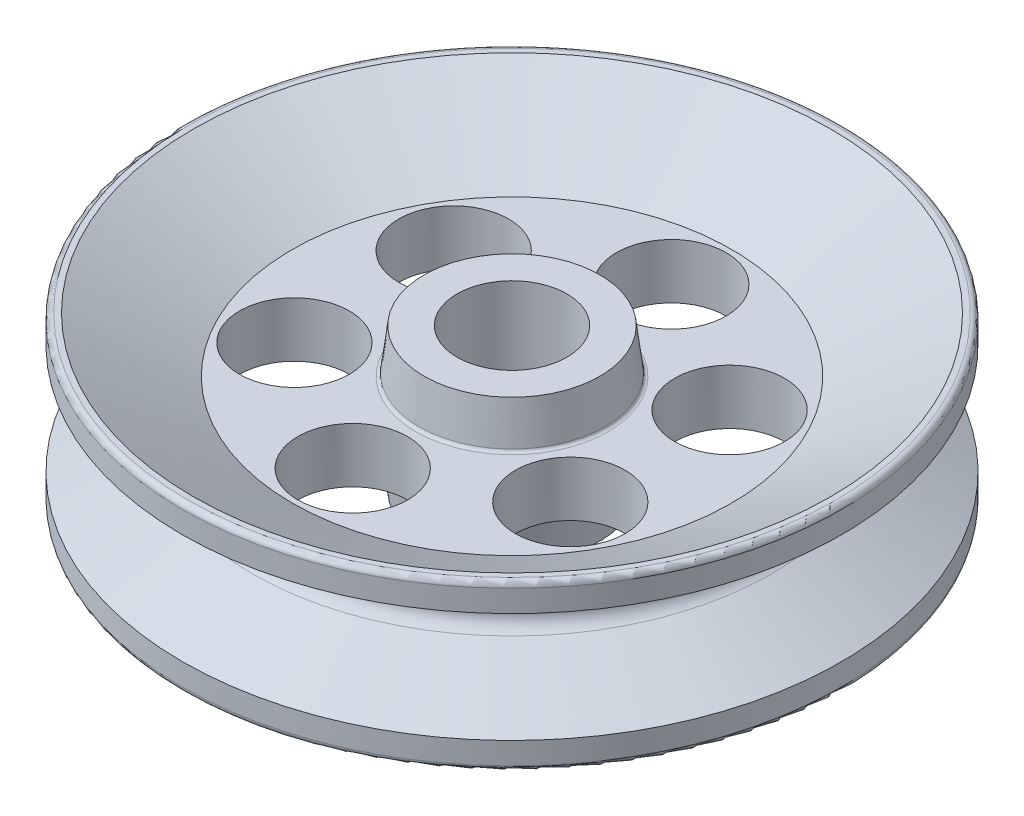
ISO-10303-21;
HEADER;
FILE_DESCRIPTION(('STEP AP214'),'2;1');
FILE_NAME('part.step','',(''),(''),'','','');
FILE_SCHEMA(('AUTOMOTIVE_DESIGN { 1 0 10303 214 1 1 1 1 }'));
ENDSEC;
DATA;
#1=APPLICATION_CONTEXT('core data for automotive mechanical design processes');
#2=APPLICATION_PROTOCOL_DEFINITION('international standard','automotive_design',2000,#1);
#3=PRODUCT_CONTEXT('',#1,'mechanical');
#4=PRODUCT('Part','Part','',(#3));
#5=PRODUCT_RELATED_PRODUCT_CATEGORY('part','',(#4));
#6=PRODUCT_DEFINITION_FORMATION('','',#4);
#7=PRODUCT_DEFINITION_CONTEXT('part definition',#1,'design');
#8=PRODUCT_DEFINITION('design','',#6,#7);
#9=PRODUCT_DEFINITION_SHAPE('','',#8);
#10=(LENGTH_UNIT() NAMED_UNIT(*) SI_UNIT(.MILLI.,.METRE.));
#11=(NAMED_UNIT(*) PLANE_ANGLE_UNIT() SI_UNIT($,.RADIAN.));
#12=(NAMED_UNIT(*) SI_UNIT($,.STERADIAN.) SOLID_ANGLE_UNIT());
#13=UNCERTAINTY_MEASURE_WITH_UNIT(LENGTH_MEASURE(1.E-05),#10,'distance_accuracy_value','');
#14=(GEOMETRIC_REPRESENTATION_CONTEXT(3) GLOBAL_UNCERTAINTY_ASSIGNED_CONTEXT((#13)) GLOBAL_UNIT_ASSIGNED_CONTEXT((#10,
#11,#12)) REPRESENTATION_CONTEXT('',''));
#15=CARTESIAN_POINT('',(0.,0.,0.));
#16=DIRECTION('',(0.,0.,1.));
#17=DIRECTION('',(1.,0.,0.));
#18=AXIS2_PLACEMENT_3D('',#15,#16,#17);
#19=CARTESIAN_POINT('',(0.,-381.,0.));
#20=DIRECTION('',(0.,1.,0.));
#21=DIRECTION('',(0.,0.,1.));
#22=AXIS2_PLACEMENT_3D('',#19,#20,#21);
#23=CYLINDRICAL_SURFACE('',#22,254.);
#24=CARTESIAN_POINT('',(0.,-330.2,0.));
#25=DIRECTION('',(0.,-1.,0.));
#26=DIRECTION('',(0.,0.,-1.));
#27=AXIS2_PLACEMENT_3D('',#24,#25,#26);
#28=CIRCLE('',#27,254.);
#29=CARTESIAN_POINT('',(0.,-330.2,-254.));
#30=VERTEX_POINT('',#29);
#31=EDGE_CURVE('E64',#30,#30,#28,.F.);
#32=ORIENTED_EDGE('',*,*,#31,.F.);
#33=EDGE_LOOP('',(#32));
#34=FACE_BOUND('',#33,.T.);
#35=CARTESIAN_POINT('',(0.,330.2,0.));
#36=DIRECTION('',(0.,1.,0.));
#37=DIRECTION('',(0.,0.,1.));
#38=AXIS2_PLACEMENT_3D('',#35,#36,#37);
#39=CIRCLE('',#38,254.);
#40=CARTESIAN_POINT('',(0.,330.2,254.));
#41=VERTEX_POINT('',#40);
#42=EDGE_CURVE('E54',#41,#41,#39,.F.);
#43=ORIENTED_EDGE('',*,*,#42,.F.);
#44=EDGE_LOOP('',(#43));
#45=FACE_BOUND('',#44,.T.);
#46=ADVANCED_FACE('F33',(#34,#45),#23,.F.);
#47=CARTESIAN_POINT('',(0.,-381.,-736.6));
#48=DIRECTION('',(0.,1.,0.));
#49=DIRECTION('',(0.,0.,1.));
#50=AXIS2_PLACEMENT_3D('',#47,#48,#49);
#51=CYLINDRICAL_SURFACE('',#50,254.);
#52=CARTESIAN_POINT('',(0.,-127.,-736.6));
#53=DIRECTION('',(0.,-1.,0.));
#54=DIRECTION('',(0.,0.,-1.));
#55=AXIS2_PLACEMENT_3D('',#52,#53,#54);
#56=CIRCLE('',#55,254.);
#57=CARTESIAN_POINT('',(0.,-127.,-990.6));
#58=VERTEX_POINT('',#57);
#59=EDGE_CURVE('E68',#58,#58,#56,.F.);
#60=ORIENTED_EDGE('',*,*,#59,.F.);
#61=EDGE_LOOP('',(#60));
#62=FACE_BOUND('',#61,.T.);
#63=CARTESIAN_POINT('',(0.,127.,-736.6));
#64=DIRECTION('',(0.,1.,0.));
#65=DIRECTION('',(0.,0.,1.));
#66=AXIS2_PLACEMENT_3D('',#63,#64,#65);
#67=CIRCLE('',#66,254.);
#68=CARTESIAN_POINT('',(0.,127.,-482.6));
#69=VERTEX_POINT('',#68);
#70=EDGE_CURVE('E58',#69,#69,#67,.F.);
#71=ORIENTED_EDGE('',*,*,#70,.F.);
#72=EDGE_LOOP('',(#71));
#73=FACE_BOUND('',#72,.T.);
#74=ADVANCED_FACE('F159',(#62,#73),#51,.F.);
#75=CARTESIAN_POINT('',(-637.914312427618,-381.,-368.299999999999));
#76=DIRECTION('',(0.,1.,0.));
#77=DIRECTION('',(0.,0.,1.));
#78=AXIS2_PLACEMENT_3D('',#75,#76,#77);
#79=CYLINDRICAL_SURFACE('',#78,254.);
#80=CARTESIAN_POINT('',(-637.914312427618,-127.,-368.299999999999));
#81=DIRECTION('',(0.,-1.,0.));
#82=DIRECTION('',(0.,0.,-1.));
#83=AXIS2_PLACEMENT_3D('',#80,#81,#82);
#84=CIRCLE('',#83,254.);
#85=CARTESIAN_POINT('',(-637.914312427618,-127.,-622.299999999998));
#86=VERTEX_POINT('',#85);
#87=EDGE_CURVE('E86',#86,#86,#84,.F.);
#88=ORIENTED_EDGE('',*,*,#87,.F.);
#89=EDGE_LOOP('',(#88));
#90=FACE_BOUND('',#89,.T.);
#91=CARTESIAN_POINT('',(-637.914312427618,127.,-368.299999999999));
#92=DIRECTION('',(0.,1.,0.));
#93=DIRECTION('',(0.,0.,1.));
#94=AXIS2_PLACEMENT_3D('',#91,#92,#93);
#95=CIRCLE('',#94,254.);
#96=CARTESIAN_POINT('',(-637.914312427618,127.,-114.299999999999));
#97=VERTEX_POINT('',#96);
#98=EDGE_CURVE('E112',#97,#97,#95,.F.);
#99=ORIENTED_EDGE('',*,*,#98,.F.);
#100=EDGE_LOOP('',(#99));
#101=FACE_BOUND('',#100,.T.);
#102=ADVANCED_FACE('F161',(#90,#101),#79,.F.);
#103=CARTESIAN_POINT('',(637.914312427613,-381.,-368.300000000007));
#104=DIRECTION('',(0.,1.,0.));
#105=DIRECTION('',(0.,0.,1.));
#106=AXIS2_PLACEMENT_3D('',#103,#104,#105);
#107=CYLINDRICAL_SURFACE('',#106,254.);
#108=CARTESIAN_POINT('',(637.914312427613,-127.,-368.300000000007));
#109=DIRECTION('',(0.,-1.,0.));
#110=DIRECTION('',(0.,0.,-1.));
#111=AXIS2_PLACEMENT_3D('',#108,#109,#110);
#112=CIRCLE('',#111,254.);
#113=CARTESIAN_POINT('',(637.914312427613,-127.,-622.300000000007));
#114=VERTEX_POINT('',#113);
#115=EDGE_CURVE('E89',#114,#114,#112,.F.);
#116=ORIENTED_EDGE('',*,*,#115,.F.);
#117=EDGE_LOOP('',(#116));
#118=FACE_BOUND('',#117,.T.);
#119=CARTESIAN_POINT('',(637.914312427613,127.,-368.300000000007));
#120=DIRECTION('',(0.,1.,0.));
#121=DIRECTION('',(0.,0.,1.));
#122=AXIS2_PLACEMENT_3D('',#119,#120,#121);
#123=CIRCLE('',#122,254.);
#124=CARTESIAN_POINT('',(637.914312427613,127.,-114.300000000007));
#125=VERTEX_POINT('',#124);
#126=EDGE_CURVE('E115',#125,#125,#123,.F.);
#127=ORIENTED_EDGE('',*,*,#126,.F.);
#128=EDGE_LOOP('',(#127));
#129=FACE_BOUND('',#128,.T.);
#130=ADVANCED_FACE('F168',(#118,#129),#107,.F.);
#131=CARTESIAN_POINT('',(637.914312427621,-381.,368.299999999994));
#132=DIRECTION('',(0.,1.,0.));
#133=DIRECTION('',(0.,0.,1.));
#134=AXIS2_PLACEMENT_3D('',#131,#132,#133);
#135=CYLINDRICAL_SURFACE('',#134,254.);
#136=CARTESIAN_POINT('',(637.914312427621,-127.,368.299999999994));
#137=DIRECTION('',(0.,-1.,0.));
#138=DIRECTION('',(0.,0.,-1.));
#139=AXIS2_PLACEMENT_3D('',#136,#137,#138);
#140=CIRCLE('',#139,254.);
#141=CARTESIAN_POINT('',(637.914312427621,-127.,114.299999999994));
#142=VERTEX_POINT('',#141);
#143=EDGE_CURVE('E92',#142,#142,#140,.F.);
#144=ORIENTED_EDGE('',*,*,#143,.F.);
#145=EDGE_LOOP('',(#144));
#146=FACE_BOUND('',#145,.T.);
#147=CARTESIAN_POINT('',(637.914312427621,127.,368.299999999994));
#148=DIRECTION('',(0.,1.,0.));
#149=DIRECTION('',(0.,0.,1.));
#150=AXIS2_PLACEMENT_3D('',#147,#148,#149);
#151=CIRCLE('',#150,254.);
#152=CARTESIAN_POINT('',(637.914312427621,127.,622.299999999994));
#153=VERTEX_POINT('',#152);
#154=EDGE_CURVE('E118',#153,#153,#151,.F.);
#155=ORIENTED_EDGE('',*,*,#154,.F.);
#156=EDGE_LOOP('',(#155));
#157=FACE_BOUND('',#156,.T.);
#158=ADVANCED_FACE('F259',(#146,#157),#135,.F.);
#159=CARTESIAN_POINT('',(0.,-381.,736.6));
#160=DIRECTION('',(0.,1.,0.));
#161=DIRECTION('',(0.,0.,1.));
#162=AXIS2_PLACEMENT_3D('',#159,#160,#161);
#163=CYLINDRICAL_SURFACE('',#162,254.);
#164=CARTESIAN_POINT('',(0.,-127.,736.6));
#165=DIRECTION('',(0.,-1.,0.));
#166=DIRECTION('',(0.,0.,-1.));
#167=AXIS2_PLACEMENT_3D('',#164,#165,#166);
#168=CIRCLE('',#167,254.);
#169=CARTESIAN_POINT('',(0.,-127.,482.6));
#170=VERTEX_POINT('',#169);
#171=EDGE_CURVE('E72',#170,#170,#168,.F.);
#172=ORIENTED_EDGE('',*,*,#171,.F.);
#173=EDGE_LOOP('',(#172));
#174=FACE_BOUND('',#173,.T.);
#175=CARTESIAN_POINT('',(0.,127.,736.6));
#176=DIRECTION('',(0.,1.,0.));
#177=DIRECTION('',(0.,0.,1.));
#178=AXIS2_PLACEMENT_3D('',#175,#176,#177);
#179=CIRCLE('',#178,254.);
#180=CARTESIAN_POINT('',(0.,127.,990.6));
#181=VERTEX_POINT('',#180);
#182=EDGE_CURVE('E62',#181,#181,#179,.F.);
#183=ORIENTED_EDGE('',*,*,#182,.F.);
#184=EDGE_LOOP('',(#183));
#185=FACE_BOUND('',#184,.T.);
#186=ADVANCED_FACE('F255',(#174,#185),#163,.F.);
#187=CARTESIAN_POINT('',(-637.914312427616,-381.,368.300000000003));
#188=DIRECTION('',(0.,1.,0.));
#189=DIRECTION('',(0.,0.,1.));
#190=AXIS2_PLACEMENT_3D('',#187,#188,#189);
#191=CYLINDRICAL_SURFACE('',#190,254.);
#192=CARTESIAN_POINT('',(-637.914312427616,-127.,368.300000000003));
#193=DIRECTION('',(0.,-1.,0.));
#194=DIRECTION('',(0.,0.,-1.));
#195=AXIS2_PLACEMENT_3D('',#192,#193,#194);
#196=CIRCLE('',#195,254.);
#197=CARTESIAN_POINT('',(-637.914312427616,-127.,114.300000000003));
#198=VERTEX_POINT('',#197);
#199=EDGE_CURVE('E69',#198,#198,#196,.F.);
#200=ORIENTED_EDGE('',*,*,#199,.F.);
#201=EDGE_LOOP('',(#200));
#202=FACE_BOUND('',#201,.T.);
#203=CARTESIAN_POINT('',(-637.914312427616,127.,368.300000000003));
#204=DIRECTION('',(0.,1.,0.));
#205=DIRECTION('',(0.,0.,1.));
#206=AXIS2_PLACEMENT_3D('',#203,#204,#205);
#207=CIRCLE('',#206,254.);
#208=CARTESIAN_POINT('',(-637.914312427616,127.,622.300000000003));
#209=VERTEX_POINT('',#208);
#210=EDGE_CURVE('E59',#209,#209,#207,.F.);
#211=ORIENTED_EDGE('',*,*,#210,.F.);
#212=EDGE_LOOP('',(#211));
#213=FACE_BOUND('',#212,.T.);
#214=ADVANCED_FACE('F198',(#202,#213),#191,.F.);
#215=CARTESIAN_POINT('',(0.,381.,0.));
#216=DIRECTION('',(0.,-1.,0.));
#217=DIRECTION('',(0.,0.,-1.));
#218=AXIS2_PLACEMENT_3D('',#215,#216,#217);
#219=CYLINDRICAL_SURFACE('',#218,1524.);
#220=CARTESIAN_POINT('',(0.,355.6,0.));
#221=DIRECTION('',(0.,1.,0.));
#222=DIRECTION('',(0.,0.,1.));
#223=AXIS2_PLACEMENT_3D('',#220,#221,#222);
#224=CIRCLE('',#223,1524.);
#225=CARTESIAN_POINT('',(0.,355.6,1524.));
#226=VERTEX_POINT('',#225);
#227=EDGE_CURVE('E44',#226,#226,#224,.F.);
#228=ORIENTED_EDGE('',*,*,#227,.T.);
#229=EDGE_LOOP('',(#228));
#230=FACE_BOUND('',#229,.T.);
#231=CARTESIAN_POINT('',(0.,254.,0.));
#232=DIRECTION('',(0.,1.,0.));
#233=DIRECTION('',(0.,0.,1.));
#234=AXIS2_PLACEMENT_3D('',#231,#232,#233);
#235=CIRCLE('',#234,1524.);
#236=CARTESIAN_POINT('',(0.,254.,1524.));
#237=VERTEX_POINT('',#236);
#238=EDGE_CURVE('E67',#237,#237,#235,.T.);
#239=ORIENTED_EDGE('',*,*,#238,.T.);
#240=EDGE_LOOP('',(#239));
#241=FACE_BOUND('',#240,.T.);
#242=ADVANCED_FACE('F192',(#230,#241),#219,.T.);
#243=CARTESIAN_POINT('',(0.,381.,0.));
#244=DIRECTION('',(0.,1.,0.));
#245=DIRECTION('',(0.,0.,1.));
#246=AXIS2_PLACEMENT_3D('',#243,#244,#245);
#247=PLANE('',#246);
#248=CARTESIAN_POINT('',(0.,381.,0.));
#249=DIRECTION('',(0.,1.,0.));
#250=DIRECTION('',(0.,0.,1.));
#251=AXIS2_PLACEMENT_3D('',#248,#249,#250);
#252=CIRCLE('',#251,1498.6);
#253=CARTESIAN_POINT('',(0.,381.,1498.6));
#254=VERTEX_POINT('',#253);
#255=EDGE_CURVE('E48',#254,#254,#252,.T.);
#256=ORIENTED_EDGE('',*,*,#255,.T.);
#257=EDGE_LOOP('',(#256));
#258=FACE_BOUND('',#257,.T.);
#259=CARTESIAN_POINT('',(0.,381.,0.));
#260=DIRECTION('',(0.,1.,0.));
#261=DIRECTION('',(0.,0.,1.));
#262=AXIS2_PLACEMENT_3D('',#259,#260,#261);
#263=CIRCLE('',#262,1473.2);
#264=CARTESIAN_POINT('',(0.,381.,1473.2));
#265=VERTEX_POINT('',#264);
#266=EDGE_CURVE('E128',#265,#265,#263,.T.);
#267=ORIENTED_EDGE('',*,*,#266,.F.);
#268=EDGE_LOOP('',(#267));
#269=FACE_BOUND('',#268,.T.);
#270=ADVANCED_FACE('F188',(#258,#269),#247,.T.);
#271=CARTESIAN_POINT('',(0.,254.,0.));
#272=DIRECTION('',(0.,1.,0.));
#273=DIRECTION('',(0.,0.,1.));
#274=AXIS2_PLACEMENT_3D('',#271,#272,#273);
#275=CONICAL_SURFACE('',#274,1524.,1.0471975511966);
#276=CARTESIAN_POINT('',(0.,65.9911357683741,0.));
#277=DIRECTION('',(0.,1.,0.));
#278=DIRECTION('',(0.,0.,1.));
#279=AXIS2_PLACEMENT_3D('',#276,#277,#278);
#280=CIRCLE('',#279,1198.35909487751);
#281=CARTESIAN_POINT('',(0.,65.9911357683741,1198.35909487751));
#282=VERTEX_POINT('',#281);
#283=EDGE_CURVE('E53',#282,#282,#280,.T.);
#284=ORIENTED_EDGE('',*,*,#283,.T.);
#285=EDGE_LOOP('',(#284));
#286=FACE_BOUND('',#285,.T.);
#287=ORIENTED_EDGE('',*,*,#238,.F.);
#288=EDGE_LOOP('',(#287));
#289=FACE_BOUND('',#288,.T.);
#290=ADVANCED_FACE('F184',(#286,#289),#275,.T.);
#291=CARTESIAN_POINT('',(0.,0.,0.));
#292=DIRECTION('',(0.,1.,0.));
#293=DIRECTION('',(0.,0.,1.));
#294=AXIS2_PLACEMENT_3D('',#291,#292,#293);
#295=TOROIDAL_SURFACE('',#294,1236.45909487751,76.2);
#296=CARTESIAN_POINT('',(0.,-65.9911357683741,0.));
#297=DIRECTION('',(0.,1.,0.));
#298=DIRECTION('',(0.,0.,1.));
#299=AXIS2_PLACEMENT_3D('',#296,#297,#298);
#300=CIRCLE('',#299,1198.35909487751);
#301=CARTESIAN_POINT('',(0.,-65.9911357683741,1198.35909487751));
#302=VERTEX_POINT('',#301);
#303=EDGE_CURVE('E76',#302,#302,#300,.T.);
#304=ORIENTED_EDGE('',*,*,#303,.T.);
#305=EDGE_LOOP('',(#304));
#306=FACE_BOUND('',#305,.T.);
#307=ORIENTED_EDGE('',*,*,#283,.F.);
#308=EDGE_LOOP('',(#307));
#309=FACE_BOUND('',#308,.T.);
#310=ADVANCED_FACE('F180',(#306,#309),#295,.F.);
#311=CARTESIAN_POINT('',(0.,-65.9911357683741,0.));
#312=DIRECTION('',(0.,-1.,0.));
#313=DIRECTION('',(0.,0.,-1.));
#314=AXIS2_PLACEMENT_3D('',#311,#312,#313);
#315=CONICAL_SURFACE('',#314,1198.35909487751,1.0471975511966);
#316=CARTESIAN_POINT('',(0.,-254.,0.));
#317=DIRECTION('',(0.,1.,0.));
#318=DIRECTION('',(0.,0.,1.));
#319=AXIS2_PLACEMENT_3D('',#316,#317,#318);
#320=CIRCLE('',#319,1524.);
#321=CARTESIAN_POINT('',(0.,-254.,1524.));
#322=VERTEX_POINT('',#321);
#323=EDGE_CURVE('E79',#322,#322,#320,.T.);
#324=ORIENTED_EDGE('',*,*,#323,.T.);
#325=EDGE_LOOP('',(#324));
#326=FACE_BOUND('',#325,.T.);
#327=ORIENTED_EDGE('',*,*,#303,.F.);
#328=EDGE_LOOP('',(#327));
#329=FACE_BOUND('',#328,.T.);
#330=ADVANCED_FACE('F176',(#326,#329),#315,.T.);
#331=CARTESIAN_POINT('',(0.,-381.,0.));
#332=DIRECTION('',(0.,1.,0.));
#333=DIRECTION('',(0.,0.,1.));
#334=AXIS2_PLACEMENT_3D('',#331,#332,#333);
#335=PLANE('',#334);
#336=CARTESIAN_POINT('',(0.,-381.,0.));
#337=DIRECTION('',(0.,1.,0.));
#338=DIRECTION('',(0.,0.,1.));
#339=AXIS2_PLACEMENT_3D('',#336,#337,#338);
#340=CIRCLE('',#339,1498.6);
#341=CARTESIAN_POINT('',(0.,-381.,1498.6));
#342=VERTEX_POINT('',#341);
#343=EDGE_CURVE('E10',#342,#342,#340,.F.);
#344=ORIENTED_EDGE('',*,*,#343,.T.);
#345=EDGE_LOOP('',(#344));
#346=FACE_BOUND('',#345,.T.);
#347=CARTESIAN_POINT('',(0.,-381.,0.));
#348=DIRECTION('',(0.,1.,0.));
#349=DIRECTION('',(0.,0.,1.));
#350=AXIS2_PLACEMENT_3D('',#347,#348,#349);
#351=CIRCLE('',#350,1473.2);
#352=CARTESIAN_POINT('',(0.,-381.,1473.2));
#353=VERTEX_POINT('',#352);
#354=EDGE_CURVE('E73',#353,#353,#351,.T.);
#355=ORIENTED_EDGE('',*,*,#354,.T.);
#356=EDGE_LOOP('',(#355));
#357=FACE_BOUND('',#356,.T.);
#358=ADVANCED_FACE('F179',(#346,#357),#335,.F.);
#359=CARTESIAN_POINT('',(0.,-355.6,0.));
#360=DIRECTION('',(0.,1.,0.));
#361=DIRECTION('',(0.,0.,1.));
#362=AXIS2_PLACEMENT_3D('',#359,#360,#361);
#363=CIRCLE('',#362,1524.);
#364=CARTESIAN_POINT('',(0.,-355.6,1524.));
#365=VERTEX_POINT('',#364);
#366=EDGE_CURVE('E40',#365,#365,#363,.T.);
#367=ORIENTED_EDGE('',*,*,#366,.T.);
#368=EDGE_LOOP('',(#367));
#369=FACE_BOUND('',#368,.T.);
#370=ORIENTED_EDGE('',*,*,#323,.F.);
#371=EDGE_LOOP('',(#370));
#372=FACE_BOUND('',#371,.T.);
#373=ADVANCED_FACE('F196',(#369,#372),#219,.T.);
#374=CARTESIAN_POINT('',(0.,-330.2,0.));
#375=DIRECTION('',(0.,-1.,0.));
#376=DIRECTION('',(0.,0.,-1.));
#377=AXIS2_PLACEMENT_3D('',#374,#375,#376);
#378=PLANE('',#377);
#379=CARTESIAN_POINT('',(0.,-330.2,0.));
#380=DIRECTION('',(0.,1.,0.));
#381=DIRECTION('',(0.,0.,1.));
#382=AXIS2_PLACEMENT_3D('',#379,#380,#381);
#383=CIRCLE('',#382,406.4);
#384=CARTESIAN_POINT('',(0.,-330.2,406.4));
#385=VERTEX_POINT('',#384);
#386=EDGE_CURVE('E57',#385,#385,#383,.T.);
#387=ORIENTED_EDGE('',*,*,#386,.F.);
#388=EDGE_LOOP('',(#387));
#389=FACE_BOUND('',#388,.T.);
#390=ORIENTED_EDGE('',*,*,#31,.T.);
#391=EDGE_LOOP('',(#390));
#392=FACE_BOUND('',#391,.T.);
#393=ADVANCED_FACE('F245',(#389,#392),#378,.T.);
#394=CARTESIAN_POINT('',(0.,-127.,-1016.));
#395=DIRECTION('',(0.,-1.,0.));
#396=DIRECTION('',(0.,0.,-1.));
#397=AXIS2_PLACEMENT_3D('',#394,#395,#396);
#398=PLANE('',#397);
#399=CARTESIAN_POINT('',(0.,-127.,0.));
#400=DIRECTION('',(0.,1.,0.));
#401=DIRECTION('',(0.,0.,1.));
#402=AXIS2_PLACEMENT_3D('',#399,#400,#401);
#403=CIRCLE('',#402,444.5);
#404=CARTESIAN_POINT('',(0.,-127.,444.5));
#405=VERTEX_POINT('',#404);
#406=EDGE_CURVE('E102',#405,#405,#403,.T.);
#407=ORIENTED_EDGE('',*,*,#406,.T.);
#408=EDGE_LOOP('',(#407));
#409=FACE_BOUND('',#408,.T.);
#410=CARTESIAN_POINT('',(0.,-127.,0.));
#411=DIRECTION('',(0.,1.,0.));
#412=DIRECTION('',(0.,0.,1.));
#413=AXIS2_PLACEMENT_3D('',#410,#411,#412);
#414=CIRCLE('',#413,1016.);
#415=CARTESIAN_POINT('',(0.,-127.,1016.));
#416=VERTEX_POINT('',#415);
#417=EDGE_CURVE('E99',#416,#416,#414,.T.);
#418=ORIENTED_EDGE('',*,*,#417,.F.);
#419=EDGE_LOOP('',(#418));
#420=FACE_BOUND('',#419,.T.);
#421=ORIENTED_EDGE('',*,*,#199,.T.);
#422=EDGE_LOOP('',(#421));
#423=FACE_BOUND('',#422,.T.);
#424=ORIENTED_EDGE('',*,*,#171,.T.);
#425=EDGE_LOOP('',(#424));
#426=FACE_BOUND('',#425,.T.);
#427=ORIENTED_EDGE('',*,*,#143,.T.);
#428=EDGE_LOOP('',(#427));
#429=FACE_BOUND('',#428,.T.);
#430=ORIENTED_EDGE('',*,*,#115,.T.);
#431=EDGE_LOOP('',(#430));
#432=FACE_BOUND('',#431,.T.);
#433=ORIENTED_EDGE('',*,*,#87,.T.);
#434=EDGE_LOOP('',(#433));
#435=FACE_BOUND('',#434,.T.);
#436=ORIENTED_EDGE('',*,*,#59,.T.);
#437=EDGE_LOOP('',(#436));
#438=FACE_BOUND('',#437,.T.);
#439=ADVANCED_FACE('F242',(#409,#420,#423,#426,#429,#432,#435,#438),#398,.T.);
#440=CARTESIAN_POINT('',(0.,-381.,0.));
#441=DIRECTION('',(0.,-1.,0.));
#442=DIRECTION('',(0.,0.,-1.));
#443=AXIS2_PLACEMENT_3D('',#440,#441,#442);
#444=CONICAL_SURFACE('',#443,1473.2,1.06369782240256);
#445=ORIENTED_EDGE('',*,*,#417,.T.);
#446=EDGE_LOOP('',(#445));
#447=FACE_BOUND('',#446,.T.);
#448=ORIENTED_EDGE('',*,*,#354,.F.);
#449=EDGE_LOOP('',(#448));
#450=FACE_BOUND('',#449,.T.);
#451=ADVANCED_FACE('F240',(#447,#450),#444,.F.);
#452=CARTESIAN_POINT('',(0.,-141.47353357562,0.));
#453=DIRECTION('',(0.,1.,0.));
#454=DIRECTION('',(0.,0.,1.));
#455=AXIS2_PLACEMENT_3D('',#452,#453,#454);
#456=TOROIDAL_SURFACE('',#455,444.5,14.4735335756199);
#457=CARTESIAN_POINT('',(0.,-139.684026624641,0.));
#458=DIRECTION('',(0.,1.,0.));
#459=DIRECTION('',(0.,0.,1.));
#460=AXIS2_PLACEMENT_3D('',#457,#458,#459);
#461=CIRCLE('',#460,430.137519746332);
#462=CARTESIAN_POINT('',(0.,-139.684026624641,430.137519746332));
#463=VERTEX_POINT('',#462);
#464=EDGE_CURVE('E105',#463,#463,#461,.T.);
#465=ORIENTED_EDGE('',*,*,#464,.T.);
#466=EDGE_LOOP('',(#465));
#467=FACE_BOUND('',#466,.T.);
#468=ORIENTED_EDGE('',*,*,#406,.F.);
#469=EDGE_LOOP('',(#468));
#470=FACE_BOUND('',#469,.T.);
#471=ADVANCED_FACE('F236',(#467,#470),#456,.F.);
#472=CARTESIAN_POINT('',(0.,-139.684026624641,0.));
#473=DIRECTION('',(0.,1.,0.));
#474=DIRECTION('',(0.,0.,1.));
#475=AXIS2_PLACEMENT_3D('',#472,#473,#474);
#476=CONICAL_SURFACE('',#475,430.137519746332,0.123957146381599);
#477=ORIENTED_EDGE('',*,*,#386,.T.);
#478=EDGE_LOOP('',(#477));
#479=FACE_BOUND('',#478,.T.);
#480=ORIENTED_EDGE('',*,*,#464,.F.);
#481=EDGE_LOOP('',(#480));
#482=FACE_BOUND('',#481,.T.);
#483=ADVANCED_FACE('F229',(#479,#482),#476,.T.);
#484=CARTESIAN_POINT('',(0.,330.2,0.));
#485=DIRECTION('',(0.,1.,0.));
#486=DIRECTION('',(0.,0.,1.));
#487=AXIS2_PLACEMENT_3D('',#484,#485,#486);
#488=PLANE('',#487);
#489=CARTESIAN_POINT('',(0.,330.2,0.));
#490=DIRECTION('',(0.,1.,0.));
#491=DIRECTION('',(0.,0.,1.));
#492=AXIS2_PLACEMENT_3D('',#489,#490,#491);
#493=CIRCLE('',#492,406.4);
#494=CARTESIAN_POINT('',(0.,330.2,406.4));
#495=VERTEX_POINT('',#494);
#496=EDGE_CURVE('E125',#495,#495,#493,.T.);
#497=ORIENTED_EDGE('',*,*,#496,.T.);
#498=EDGE_LOOP('',(#497));
#499=FACE_BOUND('',#498,.T.);
#500=ORIENTED_EDGE('',*,*,#42,.T.);
#501=EDGE_LOOP('',(#500));
#502=FACE_BOUND('',#501,.T.);
#503=ADVANCED_FACE('F144',(#499,#502),#488,.T.);
#504=CARTESIAN_POINT('',(0.,127.,-1016.));
#505=DIRECTION('',(0.,1.,0.));
#506=DIRECTION('',(0.,0.,1.));
#507=AXIS2_PLACEMENT_3D('',#504,#505,#506);
#508=PLANE('',#507);
#509=CARTESIAN_POINT('',(0.,127.,0.));
#510=DIRECTION('',(0.,1.,0.));
#511=DIRECTION('',(0.,0.,1.));
#512=AXIS2_PLACEMENT_3D('',#509,#510,#511);
#513=CIRCLE('',#512,1016.);
#514=CARTESIAN_POINT('',(0.,127.,1016.));
#515=VERTEX_POINT('',#514);
#516=EDGE_CURVE('E131',#515,#515,#513,.T.);
#517=ORIENTED_EDGE('',*,*,#516,.T.);
#518=EDGE_LOOP('',(#517));
#519=FACE_BOUND('',#518,.T.);
#520=CARTESIAN_POINT('',(0.,127.,0.));
#521=DIRECTION('',(0.,1.,0.));
#522=DIRECTION('',(0.,0.,1.));
#523=AXIS2_PLACEMENT_3D('',#520,#521,#522);
#524=CIRCLE('',#523,444.5);
#525=CARTESIAN_POINT('',(0.,127.,444.5));
#526=VERTEX_POINT('',#525);
#527=EDGE_CURVE('E134',#526,#526,#524,.T.);
#528=ORIENTED_EDGE('',*,*,#527,.F.);
#529=EDGE_LOOP('',(#528));
#530=FACE_BOUND('',#529,.T.);
#531=ORIENTED_EDGE('',*,*,#210,.T.);
#532=EDGE_LOOP('',(#531));
#533=FACE_BOUND('',#532,.T.);
#534=ORIENTED_EDGE('',*,*,#182,.T.);
#535=EDGE_LOOP('',(#534));
#536=FACE_BOUND('',#535,.T.);
#537=ORIENTED_EDGE('',*,*,#154,.T.);
#538=EDGE_LOOP('',(#537));
#539=FACE_BOUND('',#538,.T.);
#540=ORIENTED_EDGE('',*,*,#126,.T.);
#541=EDGE_LOOP('',(#540));
#542=FACE_BOUND('',#541,.T.);
#543=ORIENTED_EDGE('',*,*,#98,.T.);
#544=EDGE_LOOP('',(#543));
#545=FACE_BOUND('',#544,.T.);
#546=ORIENTED_EDGE('',*,*,#70,.T.);
#547=EDGE_LOOP('',(#546));
#548=FACE_BOUND('',#547,.T.);
#549=ADVANCED_FACE('F141',(#519,#530,#533,#536,#539,#542,#545,#548),#508,.T.);
#550=CARTESIAN_POINT('',(0.,141.47353357562,0.));
#551=DIRECTION('',(0.,1.,0.));
#552=DIRECTION('',(0.,0.,1.));
#553=AXIS2_PLACEMENT_3D('',#550,#551,#552);
#554=TOROIDAL_SURFACE('',#553,444.5,14.4735335756199);
#555=ORIENTED_EDGE('',*,*,#527,.T.);
#556=EDGE_LOOP('',(#555));
#557=FACE_BOUND('',#556,.T.);
#558=CARTESIAN_POINT('',(0.,139.684026624641,0.));
#559=DIRECTION('',(0.,1.,0.));
#560=DIRECTION('',(0.,0.,1.));
#561=AXIS2_PLACEMENT_3D('',#558,#559,#560);
#562=CIRCLE('',#561,430.137519746333);
#563=CARTESIAN_POINT('',(0.,139.684026624641,430.137519746333));
#564=VERTEX_POINT('',#563);
#565=EDGE_CURVE('E63',#564,#564,#562,.T.);
#566=ORIENTED_EDGE('',*,*,#565,.F.);
#567=EDGE_LOOP('',(#566));
#568=FACE_BOUND('',#567,.T.);
#569=ADVANCED_FACE('F138',(#557,#568),#554,.F.);
#570=CARTESIAN_POINT('',(0.,330.2,0.));
#571=DIRECTION('',(0.,-1.,0.));
#572=DIRECTION('',(0.,0.,-1.));
#573=AXIS2_PLACEMENT_3D('',#570,#571,#572);
#574=CONICAL_SURFACE('',#573,406.4,0.123957146381601);
#575=ORIENTED_EDGE('',*,*,#565,.T.);
#576=EDGE_LOOP('',(#575));
#577=FACE_BOUND('',#576,.T.);
#578=ORIENTED_EDGE('',*,*,#496,.F.);
#579=EDGE_LOOP('',(#578));
#580=FACE_BOUND('',#579,.T.);
#581=ADVANCED_FACE('F209',(#577,#580),#574,.T.);
#582=CARTESIAN_POINT('',(0.,127.,0.));
#583=DIRECTION('',(0.,1.,0.));
#584=DIRECTION('',(0.,0.,1.));
#585=AXIS2_PLACEMENT_3D('',#582,#583,#584);
#586=CONICAL_SURFACE('',#585,1016.,1.06369782240256);
#587=ORIENTED_EDGE('',*,*,#266,.T.);
#588=EDGE_LOOP('',(#587));
#589=FACE_BOUND('',#588,.T.);
#590=ORIENTED_EDGE('',*,*,#516,.F.);
#591=EDGE_LOOP('',(#590));
#592=FACE_BOUND('',#591,.T.);
#593=ADVANCED_FACE('F202',(#589,#592),#586,.F.);
#594=CARTESIAN_POINT('',(0.,355.6,0.));
#595=DIRECTION('',(0.,1.,0.));
#596=DIRECTION('',(0.,0.,1.));
#597=AXIS2_PLACEMENT_3D('',#594,#595,#596);
#598=TOROIDAL_SURFACE('',#597,1498.6,25.4);
#599=ORIENTED_EDGE('',*,*,#227,.F.);
#600=EDGE_LOOP('',(#599));
#601=FACE_BOUND('',#600,.T.);
#602=ORIENTED_EDGE('',*,*,#255,.F.);
#603=EDGE_LOOP('',(#602));
#604=FACE_BOUND('',#603,.T.);
#605=ADVANCED_FACE('F200',(#601,#604),#598,.T.);
#606=CARTESIAN_POINT('',(0.,-355.6,0.));
#607=DIRECTION('',(0.,1.,0.));
#608=DIRECTION('',(0.,0.,1.));
#609=AXIS2_PLACEMENT_3D('',#606,#607,#608);
#610=TOROIDAL_SURFACE('',#609,1498.6,25.4);
#611=ORIENTED_EDGE('',*,*,#343,.F.);
#612=EDGE_LOOP('',(#611));
#613=FACE_BOUND('',#612,.T.);
#614=ORIENTED_EDGE('',*,*,#366,.F.);
#615=EDGE_LOOP('',(#614));
#616=FACE_BOUND('',#615,.T.);
#617=ADVANCED_FACE('F35',(#613,#616),#610,.T.);
#618=CLOSED_SHELL('',(#46,#74,#102,#130,#158,#186,#214,#242,#270,#290,#310,#330,#358,#373,#393,
#439,#451,#471,#483,#503,#549,#569,#581,#593,#605,#617));
#619=MANIFOLD_SOLID_BREP('B2',#618);
#620=ADVANCED_BREP_SHAPE_REPRESENTATION('',(#18,#619),#14);
#621=SHAPE_DEFINITION_REPRESENTATION(#9,#620);
ENDSEC;
END-ISO-10303-21;
